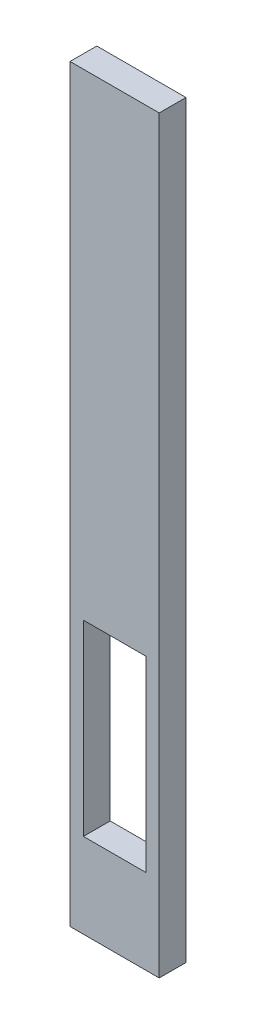
ISO-10303-21;
HEADER;
FILE_DESCRIPTION(('STEP AP214'),'2;1');
FILE_NAME('part.step','',(''),(''),'','','');
FILE_SCHEMA(('AUTOMOTIVE_DESIGN { 1 0 10303 214 1 1 1 1 }'));
ENDSEC;
DATA;
#1=APPLICATION_CONTEXT('core data for automotive mechanical design processes');
#2=APPLICATION_PROTOCOL_DEFINITION('international standard','automotive_design',2000,#1);
#3=PRODUCT_CONTEXT('',#1,'mechanical');
#4=PRODUCT('Part','Part','',(#3));
#5=PRODUCT_RELATED_PRODUCT_CATEGORY('part','',(#4));
#6=PRODUCT_DEFINITION_FORMATION('','',#4);
#7=PRODUCT_DEFINITION_CONTEXT('part definition',#1,'design');
#8=PRODUCT_DEFINITION('design','',#6,#7);
#9=PRODUCT_DEFINITION_SHAPE('','',#8);
#10=(LENGTH_UNIT() NAMED_UNIT(*) SI_UNIT(.MILLI.,.METRE.));
#11=(NAMED_UNIT(*) PLANE_ANGLE_UNIT() SI_UNIT($,.RADIAN.));
#12=(NAMED_UNIT(*) SI_UNIT($,.STERADIAN.) SOLID_ANGLE_UNIT());
#13=UNCERTAINTY_MEASURE_WITH_UNIT(LENGTH_MEASURE(1.E-05),#10,'distance_accuracy_value','');
#14=(GEOMETRIC_REPRESENTATION_CONTEXT(3) GLOBAL_UNCERTAINTY_ASSIGNED_CONTEXT((#13)) GLOBAL_UNIT_ASSIGNED_CONTEXT((#10,
#11,#12)) REPRESENTATION_CONTEXT('',''));
#15=CARTESIAN_POINT('',(0.,0.,0.));
#16=DIRECTION('',(0.,0.,1.));
#17=DIRECTION('',(1.,0.,0.));
#18=AXIS2_PLACEMENT_3D('',#15,#16,#17);
#19=CARTESIAN_POINT('',(0.,-1.92766106378343,3.));
#20=DIRECTION('',(0.,1.,0.));
#21=DIRECTION('',(-1.,0.,0.));
#22=AXIS2_PLACEMENT_3D('',#19,#20,#21);
#23=PLANE('',#22);
#24=DIRECTION('',(1.,0.,0.));
#25=VECTOR('',#24,1.);
#26=CARTESIAN_POINT('',(0.,-1.92766106378343,0.));
#27=LINE('',#26,#25);
#28=CARTESIAN_POINT('',(-8.20706306222078,-1.92766106378343,0.));
#29=VERTEX_POINT('',#28);
#30=CARTESIAN_POINT('',(-1.20706306222078,-1.92766106378343,0.));
#31=VERTEX_POINT('',#30);
#32=EDGE_CURVE('E144',#29,#31,#27,.T.);
#33=ORIENTED_EDGE('',*,*,#32,.T.);
#34=DIRECTION('',(0.,0.,-1.));
#35=VECTOR('',#34,1.);
#36=CARTESIAN_POINT('',(-1.20706306222078,-1.92766106378343,3.));
#37=LINE('',#36,#35);
#38=CARTESIAN_POINT('',(-1.20706306222078,-1.92766106378343,3.));
#39=VERTEX_POINT('',#38);
#40=EDGE_CURVE('E11',#39,#31,#37,.T.);
#41=ORIENTED_EDGE('',*,*,#40,.F.);
#42=DIRECTION('',(1.,0.,0.));
#43=VECTOR('',#42,1.);
#44=CARTESIAN_POINT('',(0.,-1.92766106378343,3.));
#45=LINE('',#44,#43);
#46=CARTESIAN_POINT('',(-8.20706306222078,-1.92766106378343,3.));
#47=VERTEX_POINT('',#46);
#48=EDGE_CURVE('E115',#47,#39,#45,.T.);
#49=ORIENTED_EDGE('',*,*,#48,.F.);
#50=DIRECTION('',(0.,0.,-1.));
#51=VECTOR('',#50,1.);
#52=CARTESIAN_POINT('',(-8.20706306222078,-1.92766106378343,3.));
#53=LINE('',#52,#51);
#54=EDGE_CURVE('E54',#47,#29,#53,.T.);
#55=ORIENTED_EDGE('',*,*,#54,.T.);
#56=EDGE_LOOP('',(#33,#41,#49,#55));
#57=FACE_BOUND('',#56,.T.);
#58=ADVANCED_FACE('F35',(#57),#23,.F.);
#59=CARTESIAN_POINT('',(-1.20706306222078,0.,3.));
#60=DIRECTION('',(1.,0.,0.));
#61=DIRECTION('',(0.,1.,0.));
#62=AXIS2_PLACEMENT_3D('',#59,#60,#61);
#63=PLANE('',#62);
#64=DIRECTION('',(0.,-1.,0.));
#65=VECTOR('',#64,1.);
#66=CARTESIAN_POINT('',(-1.20706306222078,0.,0.));
#67=LINE('',#66,#65);
#68=CARTESIAN_POINT('',(-1.20706306222077,-22.9276610637834,0.));
#69=VERTEX_POINT('',#68);
#70=EDGE_CURVE('E121',#31,#69,#67,.T.);
#71=ORIENTED_EDGE('',*,*,#70,.T.);
#72=DIRECTION('',(0.,0.,-1.));
#73=VECTOR('',#72,1.);
#74=CARTESIAN_POINT('',(-1.20706306222077,-22.9276610637834,3.));
#75=LINE('',#74,#73);
#76=CARTESIAN_POINT('',(-1.20706306222077,-22.9276610637834,3.));
#77=VERTEX_POINT('',#76);
#78=EDGE_CURVE('E45',#77,#69,#75,.T.);
#79=ORIENTED_EDGE('',*,*,#78,.F.);
#80=DIRECTION('',(0.,-1.,0.));
#81=VECTOR('',#80,1.);
#82=CARTESIAN_POINT('',(-1.20706306222078,0.,3.));
#83=LINE('',#82,#81);
#84=EDGE_CURVE('E109',#39,#77,#83,.T.);
#85=ORIENTED_EDGE('',*,*,#84,.F.);
#86=ORIENTED_EDGE('',*,*,#40,.T.);
#87=EDGE_LOOP('',(#71,#79,#85,#86));
#88=FACE_BOUND('',#87,.T.);
#89=ADVANCED_FACE('F120',(#88),#63,.F.);
#90=CARTESIAN_POINT('',(0.,-22.9276610637834,3.));
#91=DIRECTION('',(0.,1.,0.));
#92=DIRECTION('',(-1.,0.,0.));
#93=AXIS2_PLACEMENT_3D('',#90,#91,#92);
#94=PLANE('',#93);
#95=DIRECTION('',(1.,0.,0.));
#96=VECTOR('',#95,1.);
#97=CARTESIAN_POINT('',(0.,-22.9276610637834,0.));
#98=LINE('',#97,#96);
#99=CARTESIAN_POINT('',(-8.20706306222078,-22.9276610637834,0.));
#100=VERTEX_POINT('',#99);
#101=EDGE_CURVE('E147',#100,#69,#98,.T.);
#102=ORIENTED_EDGE('',*,*,#101,.F.);
#103=DIRECTION('',(0.,0.,-1.));
#104=VECTOR('',#103,1.);
#105=CARTESIAN_POINT('',(-8.20706306222078,-22.9276610637834,3.));
#106=LINE('',#105,#104);
#107=CARTESIAN_POINT('',(-8.20706306222078,-22.9276610637834,3.));
#108=VERTEX_POINT('',#107);
#109=EDGE_CURVE('E80',#108,#100,#106,.T.);
#110=ORIENTED_EDGE('',*,*,#109,.F.);
#111=DIRECTION('',(1.,0.,0.));
#112=VECTOR('',#111,1.);
#113=CARTESIAN_POINT('',(0.,-22.9276610637834,3.));
#114=LINE('',#113,#112);
#115=EDGE_CURVE('E114',#108,#77,#114,.T.);
#116=ORIENTED_EDGE('',*,*,#115,.T.);
#117=ORIENTED_EDGE('',*,*,#78,.T.);
#118=EDGE_LOOP('',(#102,#110,#116,#117));
#119=FACE_BOUND('',#118,.T.);
#120=ADVANCED_FACE('F125',(#119),#94,.T.);
#121=CARTESIAN_POINT('',(-9.70706306222079,0.,3.));
#122=DIRECTION('',(1.,0.,0.));
#123=DIRECTION('',(0.,1.,0.));
#124=AXIS2_PLACEMENT_3D('',#121,#122,#123);
#125=PLANE('',#124);
#126=DIRECTION('',(0.,-1.,0.));
#127=VECTOR('',#126,1.);
#128=CARTESIAN_POINT('',(-9.70706306222079,0.,0.));
#129=LINE('',#128,#127);
#130=CARTESIAN_POINT('',(-9.7070630622208,51.5723389362166,0.));
#131=VERTEX_POINT('',#130);
#132=CARTESIAN_POINT('',(-9.70706306222079,-32.4276610637834,0.));
#133=VERTEX_POINT('',#132);
#134=EDGE_CURVE('E132',#131,#133,#129,.T.);
#135=ORIENTED_EDGE('',*,*,#134,.T.);
#136=DIRECTION('',(0.,0.,-1.));
#137=VECTOR('',#136,1.);
#138=CARTESIAN_POINT('',(-9.70706306222079,-32.4276610637834,3.));
#139=LINE('',#138,#137);
#140=CARTESIAN_POINT('',(-9.70706306222079,-32.4276610637834,3.));
#141=VERTEX_POINT('',#140);
#142=EDGE_CURVE('E39',#141,#133,#139,.T.);
#143=ORIENTED_EDGE('',*,*,#142,.F.);
#144=DIRECTION('',(0.,-1.,0.));
#145=VECTOR('',#144,1.);
#146=CARTESIAN_POINT('',(-9.70706306222079,0.,3.));
#147=LINE('',#146,#145);
#148=CARTESIAN_POINT('',(-9.7070630622208,51.5723389362166,3.));
#149=VERTEX_POINT('',#148);
#150=EDGE_CURVE('E152',#149,#141,#147,.T.);
#151=ORIENTED_EDGE('',*,*,#150,.F.);
#152=DIRECTION('',(0.,0.,-1.));
#153=VECTOR('',#152,1.);
#154=CARTESIAN_POINT('',(-9.7070630622208,51.5723389362166,3.));
#155=LINE('',#154,#153);
#156=EDGE_CURVE('E128',#149,#131,#155,.T.);
#157=ORIENTED_EDGE('',*,*,#156,.T.);
#158=EDGE_LOOP('',(#135,#143,#151,#157));
#159=FACE_BOUND('',#158,.T.);
#160=ADVANCED_FACE('F37',(#159),#125,.F.);
#161=CARTESIAN_POINT('',(0.,-32.4276610637834,3.));
#162=DIRECTION('',(0.,1.,0.));
#163=DIRECTION('',(-1.,0.,0.));
#164=AXIS2_PLACEMENT_3D('',#161,#162,#163);
#165=PLANE('',#164);
#166=DIRECTION('',(1.,0.,0.));
#167=VECTOR('',#166,1.);
#168=CARTESIAN_POINT('',(0.,-32.4276610637834,0.));
#169=LINE('',#168,#167);
#170=CARTESIAN_POINT('',(0.292936937779213,-32.4276610637834,0.));
#171=VERTEX_POINT('',#170);
#172=EDGE_CURVE('E135',#133,#171,#169,.T.);
#173=ORIENTED_EDGE('',*,*,#172,.T.);
#174=DIRECTION('',(0.,0.,-1.));
#175=VECTOR('',#174,1.);
#176=CARTESIAN_POINT('',(0.292936937779213,-32.4276610637834,3.));
#177=LINE('',#176,#175);
#178=CARTESIAN_POINT('',(0.292936937779213,-32.4276610637834,3.));
#179=VERTEX_POINT('',#178);
#180=EDGE_CURVE('E157',#179,#171,#177,.T.);
#181=ORIENTED_EDGE('',*,*,#180,.F.);
#182=DIRECTION('',(1.,0.,0.));
#183=VECTOR('',#182,1.);
#184=CARTESIAN_POINT('',(0.,-32.4276610637834,3.));
#185=LINE('',#184,#183);
#186=EDGE_CURVE('E93',#141,#179,#185,.T.);
#187=ORIENTED_EDGE('',*,*,#186,.F.);
#188=ORIENTED_EDGE('',*,*,#142,.T.);
#189=EDGE_LOOP('',(#173,#181,#187,#188));
#190=FACE_BOUND('',#189,.T.);
#191=ADVANCED_FACE('F162',(#190),#165,.F.);
#192=CARTESIAN_POINT('',(0.292936937779209,0.,3.));
#193=DIRECTION('',(1.,0.,0.));
#194=DIRECTION('',(0.,1.,0.));
#195=AXIS2_PLACEMENT_3D('',#192,#193,#194);
#196=PLANE('',#195);
#197=DIRECTION('',(0.,-1.,0.));
#198=VECTOR('',#197,1.);
#199=CARTESIAN_POINT('',(0.292936937779209,0.,0.));
#200=LINE('',#199,#198);
#201=CARTESIAN_POINT('',(0.292936937779203,51.5723389362166,0.));
#202=VERTEX_POINT('',#201);
#203=EDGE_CURVE('E138',#202,#171,#200,.T.);
#204=ORIENTED_EDGE('',*,*,#203,.F.);
#205=DIRECTION('',(0.,0.,-1.));
#206=VECTOR('',#205,1.);
#207=CARTESIAN_POINT('',(0.292936937779203,51.5723389362166,3.));
#208=LINE('',#207,#206);
#209=CARTESIAN_POINT('',(0.292936937779203,51.5723389362166,3.));
#210=VERTEX_POINT('',#209);
#211=EDGE_CURVE('E156',#210,#202,#208,.T.);
#212=ORIENTED_EDGE('',*,*,#211,.F.);
#213=DIRECTION('',(0.,-1.,0.));
#214=VECTOR('',#213,1.);
#215=CARTESIAN_POINT('',(0.292936937779209,0.,3.));
#216=LINE('',#215,#214);
#217=EDGE_CURVE('E203',#210,#179,#216,.T.);
#218=ORIENTED_EDGE('',*,*,#217,.T.);
#219=ORIENTED_EDGE('',*,*,#180,.T.);
#220=EDGE_LOOP('',(#204,#212,#218,#219));
#221=FACE_BOUND('',#220,.T.);
#222=ADVANCED_FACE('F176',(#221),#196,.T.);
#223=CARTESIAN_POINT('',(0.,51.5723389362166,3.));
#224=DIRECTION('',(0.,1.,0.));
#225=DIRECTION('',(-1.,0.,0.));
#226=AXIS2_PLACEMENT_3D('',#223,#224,#225);
#227=PLANE('',#226);
#228=DIRECTION('',(1.,0.,0.));
#229=VECTOR('',#228,1.);
#230=CARTESIAN_POINT('',(0.,51.5723389362166,0.));
#231=LINE('',#230,#229);
#232=EDGE_CURVE('E141',#131,#202,#231,.T.);
#233=ORIENTED_EDGE('',*,*,#232,.F.);
#234=ORIENTED_EDGE('',*,*,#156,.F.);
#235=DIRECTION('',(1.,0.,0.));
#236=VECTOR('',#235,1.);
#237=CARTESIAN_POINT('',(0.,51.5723389362166,3.));
#238=LINE('',#237,#236);
#239=EDGE_CURVE('E174',#149,#210,#238,.T.);
#240=ORIENTED_EDGE('',*,*,#239,.T.);
#241=ORIENTED_EDGE('',*,*,#211,.T.);
#242=EDGE_LOOP('',(#233,#234,#240,#241));
#243=FACE_BOUND('',#242,.T.);
#244=ADVANCED_FACE('F171',(#243),#227,.T.);
#245=CARTESIAN_POINT('',(-8.20706306222078,0.,3.));
#246=DIRECTION('',(1.,0.,0.));
#247=DIRECTION('',(0.,1.,0.));
#248=AXIS2_PLACEMENT_3D('',#245,#246,#247);
#249=PLANE('',#248);
#250=DIRECTION('',(0.,-1.,0.));
#251=VECTOR('',#250,1.);
#252=CARTESIAN_POINT('',(-8.20706306222078,0.,0.));
#253=LINE('',#252,#251);
#254=EDGE_CURVE('E149',#29,#100,#253,.T.);
#255=ORIENTED_EDGE('',*,*,#254,.F.);
#256=ORIENTED_EDGE('',*,*,#54,.F.);
#257=DIRECTION('',(0.,-1.,0.));
#258=VECTOR('',#257,1.);
#259=CARTESIAN_POINT('',(-8.20706306222078,0.,3.));
#260=LINE('',#259,#258);
#261=EDGE_CURVE('E126',#47,#108,#260,.T.);
#262=ORIENTED_EDGE('',*,*,#261,.T.);
#263=ORIENTED_EDGE('',*,*,#109,.T.);
#264=EDGE_LOOP('',(#255,#256,#262,#263));
#265=FACE_BOUND('',#264,.T.);
#266=ADVANCED_FACE('F183',(#265),#249,.T.);
#267=CARTESIAN_POINT('',(0.,0.,3.));
#268=DIRECTION('',(0.,0.,1.));
#269=DIRECTION('',(1.,0.,0.));
#270=AXIS2_PLACEMENT_3D('',#267,#268,#269);
#271=PLANE('',#270);
#272=ORIENTED_EDGE('',*,*,#150,.T.);
#273=ORIENTED_EDGE('',*,*,#186,.T.);
#274=ORIENTED_EDGE('',*,*,#217,.F.);
#275=ORIENTED_EDGE('',*,*,#239,.F.);
#276=EDGE_LOOP('',(#272,#273,#274,#275));
#277=FACE_BOUND('',#276,.T.);
#278=ORIENTED_EDGE('',*,*,#48,.T.);
#279=ORIENTED_EDGE('',*,*,#84,.T.);
#280=ORIENTED_EDGE('',*,*,#115,.F.);
#281=ORIENTED_EDGE('',*,*,#261,.F.);
#282=EDGE_LOOP('',(#278,#279,#280,#281));
#283=FACE_BOUND('',#282,.T.);
#284=ADVANCED_FACE('F111',(#277,#283),#271,.T.);
#285=CARTESIAN_POINT('',(0.,0.,0.));
#286=DIRECTION('',(0.,0.,1.));
#287=DIRECTION('',(1.,0.,0.));
#288=AXIS2_PLACEMENT_3D('',#285,#286,#287);
#289=PLANE('',#288);
#290=ORIENTED_EDGE('',*,*,#134,.F.);
#291=ORIENTED_EDGE('',*,*,#232,.T.);
#292=ORIENTED_EDGE('',*,*,#203,.T.);
#293=ORIENTED_EDGE('',*,*,#172,.F.);
#294=EDGE_LOOP('',(#290,#291,#292,#293));
#295=FACE_BOUND('',#294,.T.);
#296=ORIENTED_EDGE('',*,*,#32,.F.);
#297=ORIENTED_EDGE('',*,*,#254,.T.);
#298=ORIENTED_EDGE('',*,*,#101,.T.);
#299=ORIENTED_EDGE('',*,*,#70,.F.);
#300=EDGE_LOOP('',(#296,#297,#298,#299));
#301=FACE_BOUND('',#300,.T.);
#302=ADVANCED_FACE('F168',(#295,#301),#289,.F.);
#303=CLOSED_SHELL('',(#58,#89,#120,#160,#191,#222,#244,#266,#284,#302));
#304=MANIFOLD_SOLID_BREP('B2',#303);
#305=ADVANCED_BREP_SHAPE_REPRESENTATION('',(#18,#304),#14);
#306=SHAPE_DEFINITION_REPRESENTATION(#9,#305);
ENDSEC;
END-ISO-10303-21;
